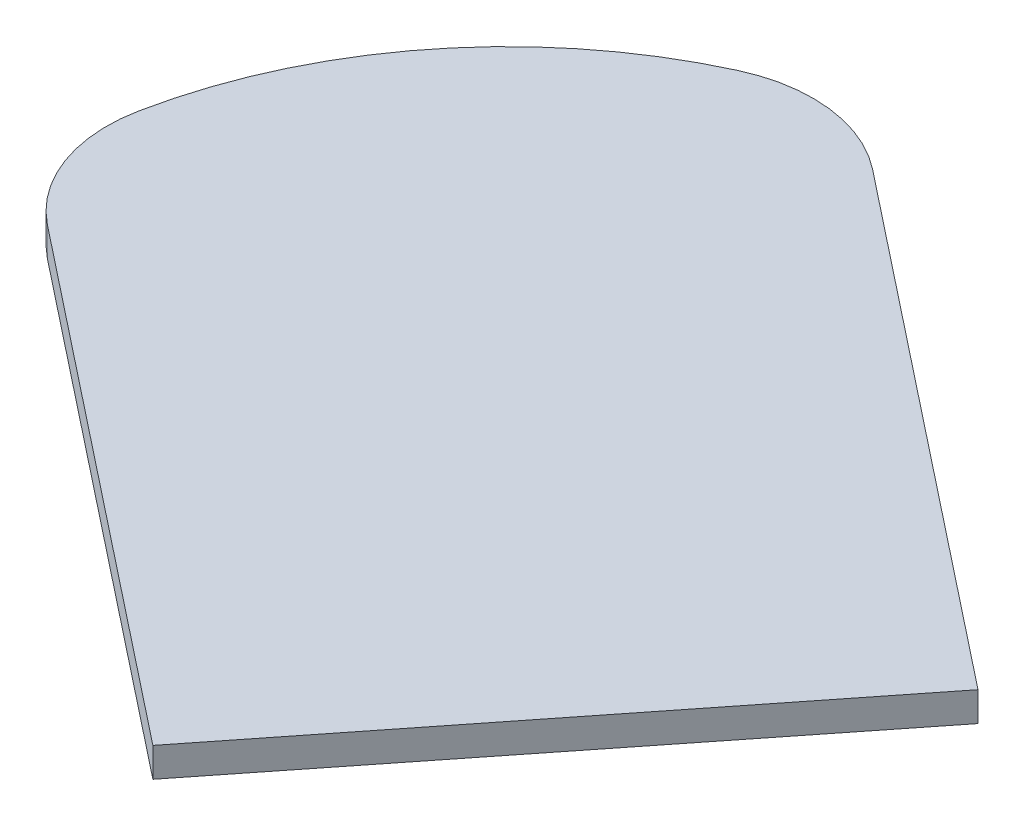
ISO-10303-21;
HEADER;
FILE_DESCRIPTION(('STEP AP214'),'2;1');
FILE_NAME('part.step','',(''),(''),'','','');
FILE_SCHEMA(('AUTOMOTIVE_DESIGN { 1 0 10303 214 1 1 1 1 }'));
ENDSEC;
DATA;
#1=APPLICATION_CONTEXT('core data for automotive mechanical design processes');
#2=APPLICATION_PROTOCOL_DEFINITION('international standard','automotive_design',2000,#1);
#3=PRODUCT_CONTEXT('',#1,'mechanical');
#4=PRODUCT('Part','Part','',(#3));
#5=PRODUCT_RELATED_PRODUCT_CATEGORY('part','',(#4));
#6=PRODUCT_DEFINITION_FORMATION('','',#4);
#7=PRODUCT_DEFINITION_CONTEXT('part definition',#1,'design');
#8=PRODUCT_DEFINITION('design','',#6,#7);
#9=PRODUCT_DEFINITION_SHAPE('','',#8);
#10=(LENGTH_UNIT() NAMED_UNIT(*) SI_UNIT(.MILLI.,.METRE.));
#11=(NAMED_UNIT(*) PLANE_ANGLE_UNIT() SI_UNIT($,.RADIAN.));
#12=(NAMED_UNIT(*) SI_UNIT($,.STERADIAN.) SOLID_ANGLE_UNIT());
#13=UNCERTAINTY_MEASURE_WITH_UNIT(LENGTH_MEASURE(1.E-05),#10,'distance_accuracy_value','');
#14=(GEOMETRIC_REPRESENTATION_CONTEXT(3) GLOBAL_UNCERTAINTY_ASSIGNED_CONTEXT((#13)) GLOBAL_UNIT_ASSIGNED_CONTEXT((#10,
#11,#12)) REPRESENTATION_CONTEXT('',''));
#15=CARTESIAN_POINT('',(0.,0.,0.));
#16=DIRECTION('',(0.,0.,1.));
#17=DIRECTION('',(1.,0.,0.));
#18=AXIS2_PLACEMENT_3D('',#15,#16,#17);
#19=CARTESIAN_POINT('',(-6.49627213780635,2.,-5.55938424072633));
#20=DIRECTION('',(0.,-1.,0.));
#21=DIRECTION('',(0.,0.,-1.));
#22=AXIS2_PLACEMENT_3D('',#19,#20,#21);
#23=CYLINDRICAL_SURFACE('',#22,32.0000000000001);
#24=CARTESIAN_POINT('',(-6.49627213780635,0.,-5.55938424072633));
#25=DIRECTION('',(0.,1.,0.));
#26=DIRECTION('',(0.,0.,1.));
#27=AXIS2_PLACEMENT_3D('',#24,#25,#26);
#28=CIRCLE('',#27,32.0000000000001);
#29=CARTESIAN_POINT('',(-19.8356209443276,0.,-34.6465252727696));
#30=VERTEX_POINT('',#29);
#31=CARTESIAN_POINT('',(-37.8767672572937,0.,-11.8255254820188));
#32=VERTEX_POINT('',#31);
#33=EDGE_CURVE('E118',#30,#32,#28,.T.);
#34=ORIENTED_EDGE('',*,*,#33,.T.);
#35=DIRECTION('',(0.,-1.,0.));
#36=VECTOR('',#35,1.);
#37=CARTESIAN_POINT('',(-37.8767672572937,2.,-11.8255254820188));
#38=LINE('',#37,#36);
#39=CARTESIAN_POINT('',(-37.8767672572937,2.,-11.8255254820188));
#40=VERTEX_POINT('',#39);
#41=EDGE_CURVE('E11',#40,#32,#38,.T.);
#42=ORIENTED_EDGE('',*,*,#41,.F.);
#43=CARTESIAN_POINT('',(-6.49627213780635,2.,-5.55938424072633));
#44=DIRECTION('',(0.,1.,0.));
#45=DIRECTION('',(0.,0.,1.));
#46=AXIS2_PLACEMENT_3D('',#43,#44,#45);
#47=CIRCLE('',#46,32.0000000000001);
#48=CARTESIAN_POINT('',(-19.8356209443276,2.,-34.6465252727696));
#49=VERTEX_POINT('',#48);
#50=EDGE_CURVE('E128',#49,#40,#47,.T.);
#51=ORIENTED_EDGE('',*,*,#50,.F.);
#52=DIRECTION('',(0.,-1.,0.));
#53=VECTOR('',#52,1.);
#54=CARTESIAN_POINT('',(-19.8356209443276,2.,-34.6465252727696));
#55=LINE('',#54,#53);
#56=EDGE_CURVE('E114',#49,#30,#55,.T.);
#57=ORIENTED_EDGE('',*,*,#56,.T.);
#58=EDGE_LOOP('',(#34,#42,#51,#57));
#59=FACE_BOUND('',#58,.T.);
#60=ADVANCED_FACE('F34',(#59),#23,.T.);
#61=CARTESIAN_POINT('',(-28.070362532454,2.,-9.86735634411503));
#62=DIRECTION('',(0.,-1.,0.));
#63=DIRECTION('',(0.,0.,-1.));
#64=AXIS2_PLACEMENT_3D('',#61,#62,#63);
#65=CYLINDRICAL_SURFACE('',#64,9.99999999999982);
#66=CARTESIAN_POINT('',(-28.070362532454,0.,-9.86735634411503));
#67=DIRECTION('',(0.,1.,0.));
#68=DIRECTION('',(0.,0.,1.));
#69=AXIS2_PLACEMENT_3D('',#66,#67,#68);
#70=CIRCLE('',#69,9.99999999999982);
#71=CARTESIAN_POINT('',(-34.2720065775369,0.,-2.02263766604347));
#72=VERTEX_POINT('',#71);
#73=EDGE_CURVE('E121',#32,#72,#70,.T.);
#74=ORIENTED_EDGE('',*,*,#73,.T.);
#75=DIRECTION('',(0.,-1.,0.));
#76=VECTOR('',#75,1.);
#77=CARTESIAN_POINT('',(-34.2720065775369,2.,-2.02263766604347));
#78=LINE('',#77,#76);
#79=CARTESIAN_POINT('',(-34.2720065775369,2.,-2.02263766604347));
#80=VERTEX_POINT('',#79);
#81=EDGE_CURVE('E42',#80,#72,#78,.T.);
#82=ORIENTED_EDGE('',*,*,#81,.F.);
#83=CARTESIAN_POINT('',(-28.070362532454,2.,-9.86735634411503));
#84=DIRECTION('',(0.,1.,0.));
#85=DIRECTION('',(0.,0.,1.));
#86=AXIS2_PLACEMENT_3D('',#83,#84,#85);
#87=CIRCLE('',#86,9.99999999999982);
#88=EDGE_CURVE('E87',#40,#80,#87,.T.);
#89=ORIENTED_EDGE('',*,*,#88,.F.);
#90=ORIENTED_EDGE('',*,*,#41,.T.);
#91=EDGE_LOOP('',(#74,#82,#89,#90));
#92=FACE_BOUND('',#91,.T.);
#93=ADVANCED_FACE('F152',(#92),#65,.T.);
#94=CARTESIAN_POINT('',(-34.2720065775369,2.,-2.02263766604347));
#95=DIRECTION('',(0.620164404508297,0.,-0.78447186780717));
#96=DIRECTION('',(-0.78447186780717,0.,-0.620164404508297));
#97=AXIS2_PLACEMENT_3D('',#94,#95,#96);
#98=PLANE('',#97);
#99=DIRECTION('',(0.78447186780717,0.,0.620164404508297));
#100=VECTOR('',#99,1.);
#101=CARTESIAN_POINT('',(-34.2720065775369,0.,-2.02263766604347));
#102=LINE('',#101,#100);
#103=CARTESIAN_POINT('',(0.0211749840954133,0.,25.0878444234077));
#104=VERTEX_POINT('',#103);
#105=EDGE_CURVE('E123',#72,#104,#102,.T.);
#106=ORIENTED_EDGE('',*,*,#105,.T.);
#107=DIRECTION('',(0.,-1.,0.));
#108=VECTOR('',#107,1.);
#109=CARTESIAN_POINT('',(0.0211749840954133,2.,25.0878444234077));
#110=LINE('',#109,#108);
#111=CARTESIAN_POINT('',(0.0211749840954133,2.,25.0878444234077));
#112=VERTEX_POINT('',#111);
#113=EDGE_CURVE('E109',#112,#104,#110,.T.);
#114=ORIENTED_EDGE('',*,*,#113,.F.);
#115=DIRECTION('',(0.78447186780717,0.,0.620164404508297));
#116=VECTOR('',#115,1.);
#117=CARTESIAN_POINT('',(-34.2720065775369,2.,-2.02263766604347));
#118=LINE('',#117,#116);
#119=EDGE_CURVE('E100',#80,#112,#118,.T.);
#120=ORIENTED_EDGE('',*,*,#119,.F.);
#121=ORIENTED_EDGE('',*,*,#81,.T.);
#122=EDGE_LOOP('',(#106,#114,#120,#121));
#123=FACE_BOUND('',#122,.T.);
#124=ADVANCED_FACE('F134',(#123),#98,.F.);
#125=CARTESIAN_POINT('',(0.0211749840954133,2.,25.0878444234077));
#126=DIRECTION('',(-0.78447186780717,0.,-0.620164404508297));
#127=DIRECTION('',(-0.620164404508297,0.,0.78447186780717));
#128=AXIS2_PLACEMENT_3D('',#125,#126,#127);
#129=PLANE('',#128);
#130=DIRECTION('',(0.620164404508297,0.,-0.78447186780717));
#131=VECTOR('',#130,1.);
#132=CARTESIAN_POINT('',(0.0211749840954133,0.,25.0878444234077));
#133=LINE('',#132,#131);
#134=CARTESIAN_POINT('',(24.8277511644254,0.,-6.2910302888767));
#135=VERTEX_POINT('',#134);
#136=EDGE_CURVE('E108',#104,#135,#133,.T.);
#137=ORIENTED_EDGE('',*,*,#136,.T.);
#138=DIRECTION('',(0.,-1.,0.));
#139=VECTOR('',#138,1.);
#140=CARTESIAN_POINT('',(24.8277511644254,2.,-6.2910302888767));
#141=LINE('',#140,#139);
#142=CARTESIAN_POINT('',(24.8277511644254,2.,-6.2910302888767));
#143=VERTEX_POINT('',#142);
#144=EDGE_CURVE('E105',#143,#135,#141,.T.);
#145=ORIENTED_EDGE('',*,*,#144,.F.);
#146=DIRECTION('',(0.620164404508297,0.,-0.78447186780717));
#147=VECTOR('',#146,1.);
#148=CARTESIAN_POINT('',(0.0211749840954133,2.,25.0878444234077));
#149=LINE('',#148,#147);
#150=EDGE_CURVE('E94',#112,#143,#149,.T.);
#151=ORIENTED_EDGE('',*,*,#150,.F.);
#152=ORIENTED_EDGE('',*,*,#113,.T.);
#153=EDGE_LOOP('',(#137,#145,#151,#152));
#154=FACE_BOUND('',#153,.T.);
#155=ADVANCED_FACE('F106',(#154),#129,.F.);
#156=CARTESIAN_POINT('',(24.8277511644254,2.,-6.2910302888767));
#157=DIRECTION('',(-0.620164404508297,0.,0.78447186780717));
#158=DIRECTION('',(0.78447186780717,0.,0.620164404508296));
#159=AXIS2_PLACEMENT_3D('',#156,#157,#158);
#160=PLANE('',#159);
#161=DIRECTION('',(-0.78447186780717,0.,-0.620164404508296));
#162=VECTOR('',#161,1.);
#163=CARTESIAN_POINT('',(24.8277511644254,0.,-6.2910302888767));
#164=LINE('',#163,#162);
#165=CARTESIAN_POINT('',(-9.4654303972069,0.,-33.4015123783279));
#166=VERTEX_POINT('',#165);
#167=EDGE_CURVE('E73',#135,#166,#164,.T.);
#168=ORIENTED_EDGE('',*,*,#167,.T.);
#169=DIRECTION('',(0.,-1.,0.));
#170=VECTOR('',#169,1.);
#171=CARTESIAN_POINT('',(-9.4654303972069,2.,-33.4015123783279));
#172=LINE('',#171,#170);
#173=CARTESIAN_POINT('',(-9.4654303972069,2.,-33.4015123783279));
#174=VERTEX_POINT('',#173);
#175=EDGE_CURVE('E110',#174,#166,#172,.T.);
#176=ORIENTED_EDGE('',*,*,#175,.F.);
#177=DIRECTION('',(-0.78447186780717,0.,-0.620164404508296));
#178=VECTOR('',#177,1.);
#179=CARTESIAN_POINT('',(24.8277511644254,2.,-6.2910302888767));
#180=LINE('',#179,#178);
#181=EDGE_CURVE('E98',#143,#174,#180,.T.);
#182=ORIENTED_EDGE('',*,*,#181,.F.);
#183=ORIENTED_EDGE('',*,*,#144,.T.);
#184=EDGE_LOOP('',(#168,#176,#182,#183));
#185=FACE_BOUND('',#184,.T.);
#186=ADVANCED_FACE('F112',(#185),#160,.F.);
#187=CARTESIAN_POINT('',(-15.6670744422898,2.,-25.5567937002565));
#188=DIRECTION('',(0.,-1.,0.));
#189=DIRECTION('',(0.,0.,-1.));
#190=AXIS2_PLACEMENT_3D('',#187,#188,#189);
#191=CYLINDRICAL_SURFACE('',#190,9.99999999999968);
#192=CARTESIAN_POINT('',(-15.6670744422898,0.,-25.5567937002565));
#193=DIRECTION('',(0.,1.,0.));
#194=DIRECTION('',(0.,0.,1.));
#195=AXIS2_PLACEMENT_3D('',#192,#193,#194);
#196=CIRCLE('',#195,9.99999999999968);
#197=EDGE_CURVE('E79',#166,#30,#196,.T.);
#198=ORIENTED_EDGE('',*,*,#197,.T.);
#199=ORIENTED_EDGE('',*,*,#56,.F.);
#200=CARTESIAN_POINT('',(-15.6670744422898,2.,-25.5567937002565));
#201=DIRECTION('',(0.,1.,0.));
#202=DIRECTION('',(0.,0.,1.));
#203=AXIS2_PLACEMENT_3D('',#200,#201,#202);
#204=CIRCLE('',#203,9.99999999999968);
#205=EDGE_CURVE('E50',#174,#49,#204,.T.);
#206=ORIENTED_EDGE('',*,*,#205,.F.);
#207=ORIENTED_EDGE('',*,*,#175,.T.);
#208=EDGE_LOOP('',(#198,#199,#206,#207));
#209=FACE_BOUND('',#208,.T.);
#210=ADVANCED_FACE('F141',(#209),#191,.T.);
#211=CARTESIAN_POINT('',(-6.49627213780635,2.,-5.55938424072633));
#212=DIRECTION('',(0.,1.,0.));
#213=DIRECTION('',(0.,0.,1.));
#214=AXIS2_PLACEMENT_3D('',#211,#212,#213);
#215=PLANE('',#214);
#216=ORIENTED_EDGE('',*,*,#50,.T.);
#217=ORIENTED_EDGE('',*,*,#88,.T.);
#218=ORIENTED_EDGE('',*,*,#119,.T.);
#219=ORIENTED_EDGE('',*,*,#150,.T.);
#220=ORIENTED_EDGE('',*,*,#181,.T.);
#221=ORIENTED_EDGE('',*,*,#205,.T.);
#222=EDGE_LOOP('',(#216,#217,#218,#219,#220,#221));
#223=FACE_BOUND('',#222,.T.);
#224=ADVANCED_FACE('F96',(#223),#215,.T.);
#225=CARTESIAN_POINT('',(-6.49627213780635,0.,-5.55938424072633));
#226=DIRECTION('',(0.,1.,0.));
#227=DIRECTION('',(0.,0.,1.));
#228=AXIS2_PLACEMENT_3D('',#225,#226,#227);
#229=PLANE('',#228);
#230=ORIENTED_EDGE('',*,*,#33,.F.);
#231=ORIENTED_EDGE('',*,*,#197,.F.);
#232=ORIENTED_EDGE('',*,*,#167,.F.);
#233=ORIENTED_EDGE('',*,*,#136,.F.);
#234=ORIENTED_EDGE('',*,*,#105,.F.);
#235=ORIENTED_EDGE('',*,*,#73,.F.);
#236=EDGE_LOOP('',(#230,#231,#232,#233,#234,#235));
#237=FACE_BOUND('',#236,.T.);
#238=ADVANCED_FACE('F137',(#237),#229,.F.);
#239=CLOSED_SHELL('',(#60,#93,#124,#155,#186,#210,#224,#238));
#240=MANIFOLD_SOLID_BREP('B2',#239);
#241=ADVANCED_BREP_SHAPE_REPRESENTATION('',(#18,#240),#14);
#242=SHAPE_DEFINITION_REPRESENTATION(#9,#241);
ENDSEC;
END-ISO-10303-21;
